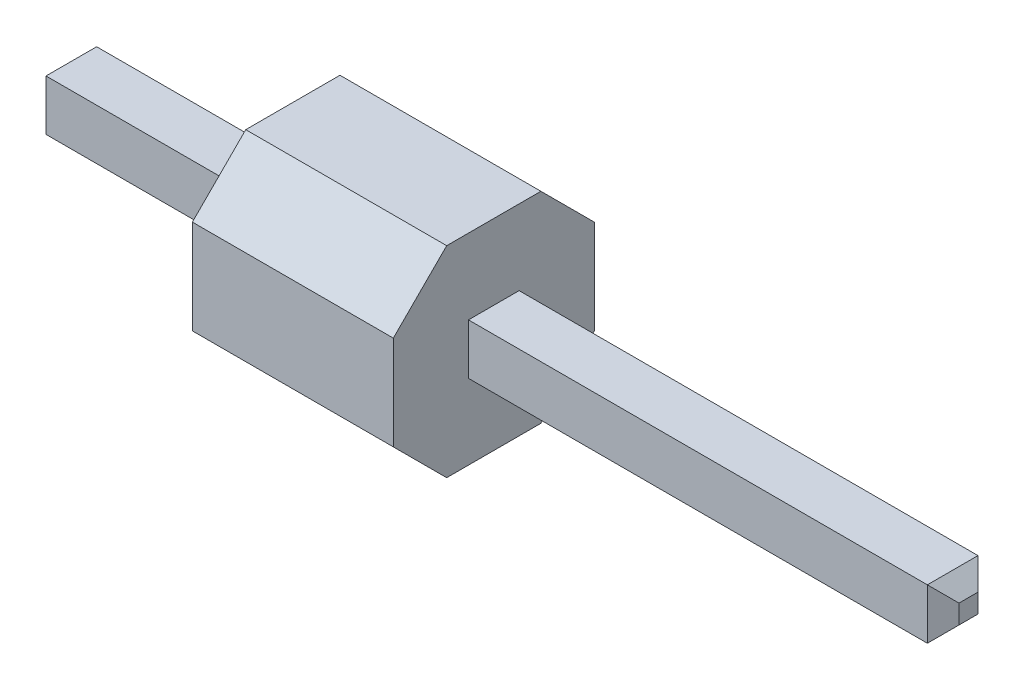
ISO-10303-21;
HEADER;
FILE_DESCRIPTION(('STEP AP214'),'2;1');
FILE_NAME('part.step','',(''),(''),'','','');
FILE_SCHEMA(('AUTOMOTIVE_DESIGN { 1 0 10303 214 1 1 1 1 }'));
ENDSEC;
DATA;
#1=APPLICATION_CONTEXT('core data for automotive mechanical design processes');
#2=APPLICATION_PROTOCOL_DEFINITION('international standard','automotive_design',2000,#1);
#3=PRODUCT_CONTEXT('',#1,'mechanical');
#4=PRODUCT('Part','Part','',(#3));
#5=PRODUCT_RELATED_PRODUCT_CATEGORY('part','',(#4));
#6=PRODUCT_DEFINITION_FORMATION('','',#4);
#7=PRODUCT_DEFINITION_CONTEXT('part definition',#1,'design');
#8=PRODUCT_DEFINITION('design','',#6,#7);
#9=PRODUCT_DEFINITION_SHAPE('','',#8);
#10=(LENGTH_UNIT() NAMED_UNIT(*) SI_UNIT(.MILLI.,.METRE.));
#11=(NAMED_UNIT(*) PLANE_ANGLE_UNIT() SI_UNIT($,.RADIAN.));
#12=(NAMED_UNIT(*) SI_UNIT($,.STERADIAN.) SOLID_ANGLE_UNIT());
#13=UNCERTAINTY_MEASURE_WITH_UNIT(LENGTH_MEASURE(1.E-05),#10,'distance_accuracy_value','');
#14=(GEOMETRIC_REPRESENTATION_CONTEXT(3) GLOBAL_UNCERTAINTY_ASSIGNED_CONTEXT((#13)) GLOBAL_UNIT_ASSIGNED_CONTEXT((#10,
#11,#12)) REPRESENTATION_CONTEXT('',''));
#15=CARTESIAN_POINT('',(0.,0.,0.));
#16=DIRECTION('',(0.,0.,1.));
#17=DIRECTION('',(1.,0.,0.));
#18=AXIS2_PLACEMENT_3D('',#15,#16,#17);
#19=CARTESIAN_POINT('',(-3.,-0.320000000000004,0.32));
#20=DIRECTION('',(0.,0.,1.));
#21=DIRECTION('',(1.,0.,0.));
#22=AXIS2_PLACEMENT_3D('',#19,#20,#21);
#23=PLANE('',#22);
#24=DIRECTION('',(1.,0.,0.));
#25=VECTOR('',#24,1.);
#26=CARTESIAN_POINT('',(-3.,0.319999999999996,0.32));
#27=LINE('',#26,#25);
#28=CARTESIAN_POINT('',(-2.8,0.319999999999996,0.32));
#29=VERTEX_POINT('',#28);
#30=CARTESIAN_POINT('',(8.34,0.319999999999996,0.32));
#31=VERTEX_POINT('',#30);
#32=EDGE_CURVE('E150',#29,#31,#27,.T.);
#33=ORIENTED_EDGE('',*,*,#32,.F.);
#34=DIRECTION('',(0.,-1.,0.));
#35=VECTOR('',#34,1.);
#36=CARTESIAN_POINT('',(-2.8,-0.320000000000004,0.32));
#37=LINE('',#36,#35);
#38=CARTESIAN_POINT('',(-2.8,-0.320000000000004,0.32));
#39=VERTEX_POINT('',#38);
#40=EDGE_CURVE('E170',#29,#39,#37,.T.);
#41=ORIENTED_EDGE('',*,*,#40,.T.);
#42=DIRECTION('',(1.,0.,0.));
#43=VECTOR('',#42,1.);
#44=CARTESIAN_POINT('',(-3.,-0.320000000000004,0.32));
#45=LINE('',#44,#43);
#46=CARTESIAN_POINT('',(8.34,-0.320000000000004,0.32));
#47=VERTEX_POINT('',#46);
#48=EDGE_CURVE('E141',#39,#47,#45,.T.);
#49=ORIENTED_EDGE('',*,*,#48,.T.);
#50=DIRECTION('',(0.,1.,0.));
#51=VECTOR('',#50,1.);
#52=CARTESIAN_POINT('',(8.34,0.319999999999996,0.32));
#53=LINE('',#52,#51);
#54=EDGE_CURVE('E168',#47,#31,#53,.T.);
#55=ORIENTED_EDGE('',*,*,#54,.T.);
#56=EDGE_LOOP('',(#33,#41,#49,#55));
#57=FACE_BOUND('',#56,.T.);
#58=ADVANCED_FACE('F45',(#57),#23,.T.);
#59=CARTESIAN_POINT('',(-3.,0.319999999999996,0.32));
#60=DIRECTION('',(0.,1.,0.));
#61=DIRECTION('',(0.,0.,1.));
#62=AXIS2_PLACEMENT_3D('',#59,#60,#61);
#63=PLANE('',#62);
#64=DIRECTION('',(1.,0.,0.));
#65=VECTOR('',#64,1.);
#66=CARTESIAN_POINT('',(-3.,0.319999999999996,-0.32));
#67=LINE('',#66,#65);
#68=CARTESIAN_POINT('',(-2.8,0.319999999999996,-0.32));
#69=VERTEX_POINT('',#68);
#70=CARTESIAN_POINT('',(8.34,0.319999999999996,-0.32));
#71=VERTEX_POINT('',#70);
#72=EDGE_CURVE('E148',#69,#71,#67,.T.);
#73=ORIENTED_EDGE('',*,*,#72,.F.);
#74=DIRECTION('',(0.,0.,1.));
#75=VECTOR('',#74,1.);
#76=CARTESIAN_POINT('',(-2.8,0.319999999999996,0.32));
#77=LINE('',#76,#75);
#78=EDGE_CURVE('E166',#69,#29,#77,.T.);
#79=ORIENTED_EDGE('',*,*,#78,.T.);
#80=ORIENTED_EDGE('',*,*,#32,.T.);
#81=DIRECTION('',(0.,0.,-1.));
#82=VECTOR('',#81,1.);
#83=CARTESIAN_POINT('',(8.34,0.319999999999996,-0.32));
#84=LINE('',#83,#82);
#85=EDGE_CURVE('E131',#31,#71,#84,.T.);
#86=ORIENTED_EDGE('',*,*,#85,.T.);
#87=EDGE_LOOP('',(#73,#79,#80,#86));
#88=FACE_BOUND('',#87,.T.);
#89=ADVANCED_FACE('F208',(#88),#63,.T.);
#90=CARTESIAN_POINT('',(-3.,-0.320000000000004,-0.32));
#91=DIRECTION('',(0.,0.,-1.));
#92=DIRECTION('',(-1.,0.,0.));
#93=AXIS2_PLACEMENT_3D('',#90,#91,#92);
#94=PLANE('',#93);
#95=DIRECTION('',(1.,0.,0.));
#96=VECTOR('',#95,1.);
#97=CARTESIAN_POINT('',(-3.,-0.320000000000004,-0.32));
#98=LINE('',#97,#96);
#99=CARTESIAN_POINT('',(-2.8,-0.320000000000004,-0.32));
#100=VERTEX_POINT('',#99);
#101=CARTESIAN_POINT('',(8.34,-0.320000000000004,-0.32));
#102=VERTEX_POINT('',#101);
#103=EDGE_CURVE('E138',#100,#102,#98,.T.);
#104=ORIENTED_EDGE('',*,*,#103,.F.);
#105=DIRECTION('',(0.,1.,0.));
#106=VECTOR('',#105,1.);
#107=CARTESIAN_POINT('',(-2.8,-0.320000000000004,-0.32));
#108=LINE('',#107,#106);
#109=EDGE_CURVE('E123',#100,#69,#108,.T.);
#110=ORIENTED_EDGE('',*,*,#109,.T.);
#111=ORIENTED_EDGE('',*,*,#72,.T.);
#112=DIRECTION('',(0.,-1.,0.));
#113=VECTOR('',#112,1.);
#114=CARTESIAN_POINT('',(8.34,-0.320000000000004,-0.32));
#115=LINE('',#114,#113);
#116=EDGE_CURVE('E132',#71,#102,#115,.T.);
#117=ORIENTED_EDGE('',*,*,#116,.T.);
#118=EDGE_LOOP('',(#104,#110,#111,#117));
#119=FACE_BOUND('',#118,.T.);
#120=ADVANCED_FACE('F146',(#119),#94,.T.);
#121=CARTESIAN_POINT('',(-3.,-0.320000000000004,0.32));
#122=DIRECTION('',(0.,-1.,0.));
#123=DIRECTION('',(0.,0.,-1.));
#124=AXIS2_PLACEMENT_3D('',#121,#122,#123);
#125=PLANE('',#124);
#126=ORIENTED_EDGE('',*,*,#48,.F.);
#127=DIRECTION('',(0.,0.,-1.));
#128=VECTOR('',#127,1.);
#129=CARTESIAN_POINT('',(-2.8,-0.320000000000004,0.32));
#130=LINE('',#129,#128);
#131=EDGE_CURVE('E115',#39,#100,#130,.T.);
#132=ORIENTED_EDGE('',*,*,#131,.T.);
#133=ORIENTED_EDGE('',*,*,#103,.T.);
#134=DIRECTION('',(0.,0.,1.));
#135=VECTOR('',#134,1.);
#136=CARTESIAN_POINT('',(8.34,-0.320000000000004,0.32));
#137=LINE('',#136,#135);
#138=EDGE_CURVE('E144',#102,#47,#137,.T.);
#139=ORIENTED_EDGE('',*,*,#138,.T.);
#140=EDGE_LOOP('',(#126,#132,#133,#139));
#141=FACE_BOUND('',#140,.T.);
#142=ADVANCED_FACE('F137',(#141),#125,.T.);
#143=CARTESIAN_POINT('',(-3.,0.,0.));
#144=DIRECTION('',(-1.,0.,0.));
#145=DIRECTION('',(0.,0.,1.));
#146=AXIS2_PLACEMENT_3D('',#143,#144,#145);
#147=PLANE('',#146);
#148=DIRECTION('',(0.,-1.,0.));
#149=VECTOR('',#148,1.);
#150=CARTESIAN_POINT('',(-3.,0.,-0.120000000000001));
#151=LINE('',#150,#149);
#152=CARTESIAN_POINT('',(-3.,0.119999999999997,-0.120000000000001));
#153=VERTEX_POINT('',#152);
#154=CARTESIAN_POINT('',(-3.,-0.120000000000006,-0.120000000000001));
#155=VERTEX_POINT('',#154);
#156=EDGE_CURVE('E160',#153,#155,#151,.T.);
#157=ORIENTED_EDGE('',*,*,#156,.T.);
#158=DIRECTION('',(0.,0.,1.));
#159=VECTOR('',#158,1.);
#160=CARTESIAN_POINT('',(-3.,-0.120000000000006,0.));
#161=LINE('',#160,#159);
#162=CARTESIAN_POINT('',(-3.,-0.120000000000006,0.120000000000001));
#163=VERTEX_POINT('',#162);
#164=EDGE_CURVE('E117',#155,#163,#161,.T.);
#165=ORIENTED_EDGE('',*,*,#164,.T.);
#166=DIRECTION('',(0.,1.,0.));
#167=VECTOR('',#166,1.);
#168=CARTESIAN_POINT('',(-3.,0.,0.120000000000001));
#169=LINE('',#168,#167);
#170=CARTESIAN_POINT('',(-3.,0.119999999999997,0.120000000000001));
#171=VERTEX_POINT('',#170);
#172=EDGE_CURVE('E143',#163,#171,#169,.T.);
#173=ORIENTED_EDGE('',*,*,#172,.T.);
#174=DIRECTION('',(0.,0.,-1.));
#175=VECTOR('',#174,1.);
#176=CARTESIAN_POINT('',(-3.,0.119999999999997,0.));
#177=LINE('',#176,#175);
#178=EDGE_CURVE('E158',#171,#153,#177,.T.);
#179=ORIENTED_EDGE('',*,*,#178,.T.);
#180=EDGE_LOOP('',(#157,#165,#173,#179));
#181=FACE_BOUND('',#180,.T.);
#182=ADVANCED_FACE('F203',(#181),#147,.T.);
#183=CARTESIAN_POINT('',(8.54,0.,0.));
#184=DIRECTION('',(-1.,0.,0.));
#185=DIRECTION('',(0.,0.,1.));
#186=AXIS2_PLACEMENT_3D('',#183,#184,#185);
#187=PLANE('',#186);
#188=DIRECTION('',(0.,1.,0.));
#189=VECTOR('',#188,1.);
#190=CARTESIAN_POINT('',(8.54,0.319999999999996,-0.120000000000001));
#191=LINE('',#190,#189);
#192=CARTESIAN_POINT('',(8.54,-0.120000000000006,-0.120000000000001));
#193=VERTEX_POINT('',#192);
#194=CARTESIAN_POINT('',(8.54,0.119999999999997,-0.120000000000001));
#195=VERTEX_POINT('',#194);
#196=EDGE_CURVE('E54',#193,#195,#191,.T.);
#197=ORIENTED_EDGE('',*,*,#196,.T.);
#198=DIRECTION('',(0.,0.,1.));
#199=VECTOR('',#198,1.);
#200=CARTESIAN_POINT('',(8.54,0.119999999999997,0.32));
#201=LINE('',#200,#199);
#202=CARTESIAN_POINT('',(8.54,0.119999999999997,0.120000000000001));
#203=VERTEX_POINT('',#202);
#204=EDGE_CURVE('E12',#195,#203,#201,.T.);
#205=ORIENTED_EDGE('',*,*,#204,.T.);
#206=DIRECTION('',(0.,-1.,0.));
#207=VECTOR('',#206,1.);
#208=CARTESIAN_POINT('',(8.54,-0.320000000000004,0.120000000000001));
#209=LINE('',#208,#207);
#210=CARTESIAN_POINT('',(8.54,-0.120000000000006,0.120000000000001));
#211=VERTEX_POINT('',#210);
#212=EDGE_CURVE('E172',#203,#211,#209,.T.);
#213=ORIENTED_EDGE('',*,*,#212,.T.);
#214=DIRECTION('',(0.,0.,-1.));
#215=VECTOR('',#214,1.);
#216=CARTESIAN_POINT('',(8.54,-0.120000000000006,-0.32));
#217=LINE('',#216,#215);
#218=EDGE_CURVE('E65',#211,#193,#217,.T.);
#219=ORIENTED_EDGE('',*,*,#218,.T.);
#220=EDGE_LOOP('',(#197,#205,#213,#219));
#221=FACE_BOUND('',#220,.T.);
#222=ADVANCED_FACE('F215',(#221),#187,.F.);
#223=CARTESIAN_POINT('',(-2.8,0.319999999999996,0.32));
#224=DIRECTION('',(0.707106781186551,-0.707106781186544,0.));
#225=DIRECTION('',(0.,0.,1.));
#226=AXIS2_PLACEMENT_3D('',#223,#224,#225);
#227=PLANE('',#226);
#228=DIRECTION('',(-0.577350269189622,-0.577350269189627,0.577350269189627));
#229=VECTOR('',#228,1.);
#230=CARTESIAN_POINT('',(-3.01333333333334,0.106666666666661,-0.106666666666665));
#231=LINE('',#230,#229);
#232=EDGE_CURVE('E126',#153,#69,#231,.F.);
#233=ORIENTED_EDGE('',*,*,#232,.F.);
#234=ORIENTED_EDGE('',*,*,#178,.F.);
#235=DIRECTION('',(-0.577350269189622,-0.577350269189627,-0.577350269189627));
#236=VECTOR('',#235,1.);
#237=CARTESIAN_POINT('',(-3.01333333333334,0.106666666666661,0.106666666666665));
#238=LINE('',#237,#236);
#239=EDGE_CURVE('E152',#29,#171,#238,.T.);
#240=ORIENTED_EDGE('',*,*,#239,.F.);
#241=ORIENTED_EDGE('',*,*,#78,.F.);
#242=EDGE_LOOP('',(#233,#234,#240,#241));
#243=FACE_BOUND('',#242,.T.);
#244=ADVANCED_FACE('F206',(#243),#227,.F.);
#245=CARTESIAN_POINT('',(-2.8,-0.320000000000004,0.32));
#246=DIRECTION('',(0.707106781186551,0.,-0.707106781186544));
#247=DIRECTION('',(0.,-1.,0.));
#248=AXIS2_PLACEMENT_3D('',#245,#246,#247);
#249=PLANE('',#248);
#250=ORIENTED_EDGE('',*,*,#239,.T.);
#251=ORIENTED_EDGE('',*,*,#172,.F.);
#252=DIRECTION('',(0.577350269189622,-0.577350269189627,0.577350269189627));
#253=VECTOR('',#252,1.);
#254=CARTESIAN_POINT('',(-2.8,-0.320000000000004,0.32));
#255=LINE('',#254,#253);
#256=EDGE_CURVE('E120',#39,#163,#255,.F.);
#257=ORIENTED_EDGE('',*,*,#256,.F.);
#258=ORIENTED_EDGE('',*,*,#40,.F.);
#259=EDGE_LOOP('',(#250,#251,#257,#258));
#260=FACE_BOUND('',#259,.T.);
#261=ADVANCED_FACE('F199',(#260),#249,.F.);
#262=CARTESIAN_POINT('',(-2.8,-0.320000000000004,-0.32));
#263=DIRECTION('',(0.707106781186551,0.,0.707106781186544));
#264=DIRECTION('',(0.,1.,0.));
#265=AXIS2_PLACEMENT_3D('',#262,#263,#264);
#266=PLANE('',#265);
#267=ORIENTED_EDGE('',*,*,#232,.T.);
#268=ORIENTED_EDGE('',*,*,#109,.F.);
#269=DIRECTION('',(-0.577350269189622,0.577350269189627,0.577350269189627));
#270=VECTOR('',#269,1.);
#271=CARTESIAN_POINT('',(-2.8,-0.320000000000004,-0.32));
#272=LINE('',#271,#270);
#273=EDGE_CURVE('E111',#155,#100,#272,.F.);
#274=ORIENTED_EDGE('',*,*,#273,.F.);
#275=ORIENTED_EDGE('',*,*,#156,.F.);
#276=EDGE_LOOP('',(#267,#268,#274,#275));
#277=FACE_BOUND('',#276,.T.);
#278=ADVANCED_FACE('F124',(#277),#266,.F.);
#279=CARTESIAN_POINT('',(-2.8,-0.320000000000004,0.32));
#280=DIRECTION('',(0.707106781186551,0.707106781186544,0.));
#281=DIRECTION('',(0.,0.,-1.));
#282=AXIS2_PLACEMENT_3D('',#279,#280,#281);
#283=PLANE('',#282);
#284=ORIENTED_EDGE('',*,*,#256,.T.);
#285=ORIENTED_EDGE('',*,*,#164,.F.);
#286=ORIENTED_EDGE('',*,*,#273,.T.);
#287=ORIENTED_EDGE('',*,*,#131,.F.);
#288=EDGE_LOOP('',(#284,#285,#286,#287));
#289=FACE_BOUND('',#288,.T.);
#290=ADVANCED_FACE('F113',(#289),#283,.F.);
#291=CARTESIAN_POINT('',(8.54,-0.120000000000006,0.));
#292=DIRECTION('',(0.707106781186548,-0.707106781186548,0.));
#293=DIRECTION('',(0.,0.,1.));
#294=AXIS2_PLACEMENT_3D('',#291,#292,#293);
#295=PLANE('',#294);
#296=DIRECTION('',(0.577350269189626,0.577350269189626,-0.577350269189626));
#297=VECTOR('',#296,1.);
#298=CARTESIAN_POINT('',(8.58,-0.0800000000000037,0.0799999999999993));
#299=LINE('',#298,#297);
#300=EDGE_CURVE('E183',#47,#211,#299,.T.);
#301=ORIENTED_EDGE('',*,*,#300,.F.);
#302=ORIENTED_EDGE('',*,*,#138,.F.);
#303=DIRECTION('',(0.577350269189626,0.577350269189626,0.577350269189626));
#304=VECTOR('',#303,1.);
#305=CARTESIAN_POINT('',(8.58,-0.0800000000000052,-0.0800000000000008));
#306=LINE('',#305,#304);
#307=EDGE_CURVE('E49',#193,#102,#306,.F.);
#308=ORIENTED_EDGE('',*,*,#307,.F.);
#309=ORIENTED_EDGE('',*,*,#218,.F.);
#310=EDGE_LOOP('',(#301,#302,#308,#309));
#311=FACE_BOUND('',#310,.T.);
#312=ADVANCED_FACE('F47',(#311),#295,.T.);
#313=CARTESIAN_POINT('',(8.54,0.,-0.120000000000001));
#314=DIRECTION('',(0.707106781186548,0.,-0.707106781186548));
#315=DIRECTION('',(0.,-1.,0.));
#316=AXIS2_PLACEMENT_3D('',#313,#314,#315);
#317=PLANE('',#316);
#318=ORIENTED_EDGE('',*,*,#307,.T.);
#319=ORIENTED_EDGE('',*,*,#116,.F.);
#320=DIRECTION('',(0.577350269189626,-0.577350269189626,0.577350269189626));
#321=VECTOR('',#320,1.);
#322=CARTESIAN_POINT('',(8.58,0.0799999999999979,-0.0800000000000023));
#323=LINE('',#322,#321);
#324=EDGE_CURVE('E182',#195,#71,#323,.F.);
#325=ORIENTED_EDGE('',*,*,#324,.F.);
#326=ORIENTED_EDGE('',*,*,#196,.F.);
#327=EDGE_LOOP('',(#318,#319,#325,#326));
#328=FACE_BOUND('',#327,.T.);
#329=ADVANCED_FACE('F191',(#328),#317,.T.);
#330=CARTESIAN_POINT('',(8.54,0.,0.120000000000001));
#331=DIRECTION('',(0.707106781186548,0.,0.707106781186548));
#332=DIRECTION('',(0.,1.,0.));
#333=AXIS2_PLACEMENT_3D('',#330,#331,#332);
#334=PLANE('',#333);
#335=ORIENTED_EDGE('',*,*,#300,.T.);
#336=ORIENTED_EDGE('',*,*,#212,.F.);
#337=DIRECTION('',(-0.577350269189626,0.577350269189626,0.577350269189626));
#338=VECTOR('',#337,1.);
#339=CARTESIAN_POINT('',(8.58,0.0799999999999979,0.0800000000000022));
#340=LINE('',#339,#338);
#341=EDGE_CURVE('E180',#31,#203,#340,.F.);
#342=ORIENTED_EDGE('',*,*,#341,.F.);
#343=ORIENTED_EDGE('',*,*,#54,.F.);
#344=EDGE_LOOP('',(#335,#336,#342,#343));
#345=FACE_BOUND('',#344,.T.);
#346=ADVANCED_FACE('F214',(#345),#334,.T.);
#347=CARTESIAN_POINT('',(8.54,0.119999999999997,0.));
#348=DIRECTION('',(0.707106781186548,0.707106781186548,0.));
#349=DIRECTION('',(0.,0.,-1.));
#350=AXIS2_PLACEMENT_3D('',#347,#348,#349);
#351=PLANE('',#350);
#352=ORIENTED_EDGE('',*,*,#324,.T.);
#353=ORIENTED_EDGE('',*,*,#85,.F.);
#354=ORIENTED_EDGE('',*,*,#341,.T.);
#355=ORIENTED_EDGE('',*,*,#204,.F.);
#356=EDGE_LOOP('',(#352,#353,#354,#355));
#357=FACE_BOUND('',#356,.T.);
#358=ADVANCED_FACE('F212',(#357),#351,.T.);
#359=CLOSED_SHELL('',(#58,#89,#120,#142,#182,#222,#244,#261,#278,#290,#312,#329,#346,#358));
#360=MANIFOLD_SOLID_BREP('B2',#359);
#361=CARTESIAN_POINT('',(2.54,0.,-1.27));
#362=DIRECTION('',(0.,0.,-1.));
#363=DIRECTION('',(-1.,0.,0.));
#364=AXIS2_PLACEMENT_3D('',#361,#362,#363);
#365=PLANE('',#364);
#366=DIRECTION('',(-1.,0.,0.));
#367=VECTOR('',#366,1.);
#368=CARTESIAN_POINT('',(2.54,-0.595482683000005,-1.27));
#369=LINE('',#368,#367);
#370=CARTESIAN_POINT('',(2.54,-0.595482683000005,-1.27));
#371=VERTEX_POINT('',#370);
#372=CARTESIAN_POINT('',(0.516526244231714,-0.595482683000005,-1.27));
#373=VERTEX_POINT('',#372);
#374=EDGE_CURVE('E353',#371,#373,#369,.T.);
#375=ORIENTED_EDGE('',*,*,#374,.T.);
#376=DIRECTION('',(0.,1.,0.));
#377=VECTOR('',#376,1.);
#378=CARTESIAN_POINT('',(0.516526244231714,0.,-1.27));
#379=LINE('',#378,#377);
#380=CARTESIAN_POINT('',(0.516526244231714,0.595482682999996,-1.27));
#381=VERTEX_POINT('',#380);
#382=EDGE_CURVE('E523',#373,#381,#379,.T.);
#383=ORIENTED_EDGE('',*,*,#382,.T.);
#384=DIRECTION('',(-1.,0.,0.));
#385=VECTOR('',#384,1.);
#386=CARTESIAN_POINT('',(2.54,0.595482682999996,-1.27));
#387=LINE('',#386,#385);
#388=CARTESIAN_POINT('',(2.54,0.595482682999996,-1.27));
#389=VERTEX_POINT('',#388);
#390=EDGE_CURVE('E501',#389,#381,#387,.T.);
#391=ORIENTED_EDGE('',*,*,#390,.F.);
#392=DIRECTION('',(0.,-1.,0.));
#393=VECTOR('',#392,1.);
#394=CARTESIAN_POINT('',(2.54,0.,-1.27));
#395=LINE('',#394,#393);
#396=EDGE_CURVE('E524',#389,#371,#395,.T.);
#397=ORIENTED_EDGE('',*,*,#396,.T.);
#398=EDGE_LOOP('',(#375,#383,#391,#397));
#399=FACE_BOUND('',#398,.T.);
#400=ADVANCED_FACE('F329',(#399),#365,.T.);
#401=CARTESIAN_POINT('',(2.54,0.932741341499998,-0.932741341499998));
#402=DIRECTION('',(0.,-0.707106781186548,0.707106781186547));
#403=DIRECTION('',(0.,-0.707106781186547,-0.707106781186548));
#404=AXIS2_PLACEMENT_3D('',#401,#402,#403);
#405=PLANE('',#404);
#406=DIRECTION('',(0.843892829702787,-0.37937111907486,-0.37937111907486));
#407=VECTOR('',#406,1.);
#408=CARTESIAN_POINT('',(1.80013672972488,0.109846190350624,-1.75563649264937));
#409=LINE('',#408,#407);
#410=CARTESIAN_POINT('',(0.,0.919095732006294,-0.946386950993702));
#411=VERTEX_POINT('',#410);
#412=CARTESIAN_POINT('',(0.457528496239407,0.713414285834849,-1.15206839716515));
#413=VERTEX_POINT('',#412);
#414=EDGE_CURVE('E552',#411,#413,#409,.T.);
#415=ORIENTED_EDGE('',*,*,#414,.F.);
#416=DIRECTION('',(0.,0.707106781186547,0.707106781186548));
#417=VECTOR('',#416,1.);
#418=CARTESIAN_POINT('',(0.,0.932741341499998,-0.932741341499998));
#419=LINE('',#418,#417);
#420=CARTESIAN_POINT('',(0.,1.27,-0.595482683));
#421=VERTEX_POINT('',#420);
#422=EDGE_CURVE('E473',#411,#421,#419,.T.);
#423=ORIENTED_EDGE('',*,*,#422,.T.);
#424=DIRECTION('',(-1.,0.,0.));
#425=VECTOR('',#424,1.);
#426=CARTESIAN_POINT('',(2.54,1.27,-0.595482683));
#427=LINE('',#426,#425);
#428=CARTESIAN_POINT('',(2.54,1.27,-0.595482683));
#429=VERTEX_POINT('',#428);
#430=EDGE_CURVE('E498',#429,#421,#427,.T.);
#431=ORIENTED_EDGE('',*,*,#430,.F.);
#432=DIRECTION('',(0.,0.707106781186547,0.707106781186548));
#433=VECTOR('',#432,1.);
#434=CARTESIAN_POINT('',(2.54,0.932741341499998,-0.932741341499998));
#435=LINE('',#434,#433);
#436=EDGE_CURVE('E527',#389,#429,#435,.T.);
#437=ORIENTED_EDGE('',*,*,#436,.F.);
#438=ORIENTED_EDGE('',*,*,#390,.T.);
#439=DIRECTION('',(0.,-0.707106781186547,-0.707106781186548));
#440=VECTOR('',#439,1.);
#441=CARTESIAN_POINT('',(0.516526244231711,0.93274134149999,-0.932741341500006));
#442=LINE('',#441,#440);
#443=CARTESIAN_POINT('',(0.516526244231714,0.62220674595849,-1.24327593704151));
#444=VERTEX_POINT('',#443);
#445=EDGE_CURVE('E557',#444,#381,#442,.T.);
#446=ORIENTED_EDGE('',*,*,#445,.F.);
#447=CARTESIAN_POINT('',(0.416526244231714,0.62220674595849,-1.24327593704151));
#448=DIRECTION('',(0.,-0.707106781186548,0.707106781186547));
#449=DIRECTION('',(0.,-0.707106781186547,-0.707106781186548));
#450=AXIS2_PLACEMENT_3D('',#447,#448,#449);
#451=ELLIPSE('',#450,0.141421356237309,0.0999999999999998);
#452=EDGE_CURVE('E465',#413,#444,#451,.F.);
#453=ORIENTED_EDGE('',*,*,#452,.F.);
#454=EDGE_LOOP('',(#415,#423,#431,#437,#438,#446,#453));
#455=FACE_BOUND('',#454,.T.);
#456=ADVANCED_FACE('F549',(#455),#405,.F.);
#457=CARTESIAN_POINT('',(2.54,-0.932741341500002,-0.932741341500002));
#458=DIRECTION('',(0.,-0.707106781186548,-0.707106781186548));
#459=DIRECTION('',(0.,0.707106781186548,-0.707106781186548));
#460=AXIS2_PLACEMENT_3D('',#457,#458,#459);
#461=PLANE('',#460);
#462=DIRECTION('',(0.,-0.707106781186548,0.707106781186548));
#463=VECTOR('',#462,1.);
#464=CARTESIAN_POINT('',(0.,-0.932741341500002,-0.932741341500002));
#465=LINE('',#464,#463);
#466=CARTESIAN_POINT('',(0.,-0.919095732006303,-0.946386950993702));
#467=VERTEX_POINT('',#466);
#468=CARTESIAN_POINT('',(0.,-1.27,-0.595482683));
#469=VERTEX_POINT('',#468);
#470=EDGE_CURVE('E393',#467,#469,#465,.T.);
#471=ORIENTED_EDGE('',*,*,#470,.F.);
#472=DIRECTION('',(0.843892829702787,0.37937111907486,-0.37937111907486));
#473=VECTOR('',#472,1.);
#474=CARTESIAN_POINT('',(1.80013672972488,-0.109846190350631,-1.75563649264937));
#475=LINE('',#474,#473);
#476=CARTESIAN_POINT('',(0.457528496239407,-0.713414285834858,-1.15206839716515));
#477=VERTEX_POINT('',#476);
#478=EDGE_CURVE('E344',#467,#477,#475,.T.);
#479=ORIENTED_EDGE('',*,*,#478,.T.);
#480=CARTESIAN_POINT('',(0.416526244231714,-0.622206745958499,-1.24327593704151));
#481=DIRECTION('',(0.,-0.707106781186548,-0.707106781186548));
#482=DIRECTION('',(0.,-0.707106781186548,0.707106781186548));
#483=AXIS2_PLACEMENT_3D('',#480,#481,#482);
#484=ELLIPSE('',#483,0.141421356237309,0.0999999999999998);
#485=CARTESIAN_POINT('',(0.516526244231714,-0.622206745958498,-1.24327593704151));
#486=VERTEX_POINT('',#485);
#487=EDGE_CURVE('E43',#477,#486,#484,.F.);
#488=ORIENTED_EDGE('',*,*,#487,.T.);
#489=DIRECTION('',(0.,0.707106781186548,-0.707106781186548));
#490=VECTOR('',#489,1.);
#491=CARTESIAN_POINT('',(0.516526244231711,-0.932741341499994,-0.932741341500011));
#492=LINE('',#491,#490);
#493=EDGE_CURVE('E337',#486,#373,#492,.T.);
#494=ORIENTED_EDGE('',*,*,#493,.T.);
#495=ORIENTED_EDGE('',*,*,#374,.F.);
#496=DIRECTION('',(0.,-0.707106781186548,0.707106781186548));
#497=VECTOR('',#496,1.);
#498=CARTESIAN_POINT('',(2.54,-0.932741341500002,-0.932741341500002));
#499=LINE('',#498,#497);
#500=CARTESIAN_POINT('',(2.54,-1.27,-0.595482683));
#501=VERTEX_POINT('',#500);
#502=EDGE_CURVE('E455',#371,#501,#499,.T.);
#503=ORIENTED_EDGE('',*,*,#502,.T.);
#504=DIRECTION('',(-1.,0.,0.));
#505=VECTOR('',#504,1.);
#506=CARTESIAN_POINT('',(2.54,-1.27,-0.595482683));
#507=LINE('',#506,#505);
#508=EDGE_CURVE('E442',#501,#469,#507,.T.);
#509=ORIENTED_EDGE('',*,*,#508,.T.);
#510=EDGE_LOOP('',(#471,#479,#488,#494,#495,#503,#509));
#511=FACE_BOUND('',#510,.T.);
#512=ADVANCED_FACE('F514',(#511),#461,.T.);
#513=CARTESIAN_POINT('',(0.,0.,0.));
#514=DIRECTION('',(1.,0.,0.));
#515=DIRECTION('',(0.,0.,-1.));
#516=AXIS2_PLACEMENT_3D('',#513,#514,#515);
#517=PLANE('',#516);
#518=DIRECTION('',(0.,-1.,0.));
#519=VECTOR('',#518,1.);
#520=CARTESIAN_POINT('',(0.,0.,0.32));
#521=LINE('',#520,#519);
#522=CARTESIAN_POINT('',(0.,0.319999999999996,0.32));
#523=VERTEX_POINT('',#522);
#524=CARTESIAN_POINT('',(0.,-0.320000000000004,0.32));
#525=VERTEX_POINT('',#524);
#526=EDGE_CURVE('E461',#523,#525,#521,.T.);
#527=ORIENTED_EDGE('',*,*,#526,.T.);
#528=DIRECTION('',(0.,0.,1.));
#529=VECTOR('',#528,1.);
#530=CARTESIAN_POINT('',(0.,-0.320000000000004,0.));
#531=LINE('',#530,#529);
#532=CARTESIAN_POINT('',(0.,-0.320000000000004,-0.32));
#533=VERTEX_POINT('',#532);
#534=EDGE_CURVE('E470',#533,#525,#531,.T.);
#535=ORIENTED_EDGE('',*,*,#534,.F.);
#536=DIRECTION('',(0.,-1.,0.));
#537=VECTOR('',#536,1.);
#538=CARTESIAN_POINT('',(0.,0.,-0.32));
#539=LINE('',#538,#537);
#540=CARTESIAN_POINT('',(0.,0.319999999999996,-0.32));
#541=VERTEX_POINT('',#540);
#542=EDGE_CURVE('E468',#541,#533,#539,.T.);
#543=ORIENTED_EDGE('',*,*,#542,.F.);
#544=DIRECTION('',(0.,0.,1.));
#545=VECTOR('',#544,1.);
#546=CARTESIAN_POINT('',(0.,0.319999999999996,0.));
#547=LINE('',#546,#545);
#548=EDGE_CURVE('E464',#541,#523,#547,.T.);
#549=ORIENTED_EDGE('',*,*,#548,.T.);
#550=EDGE_LOOP('',(#527,#535,#543,#549));
#551=FACE_BOUND('',#550,.T.);
#552=DIRECTION('',(0.,1.,0.));
#553=VECTOR('',#552,1.);
#554=CARTESIAN_POINT('',(0.,0.,-0.946386950993702));
#555=LINE('',#554,#553);
#556=EDGE_CURVE('E504',#467,#411,#555,.T.);
#557=ORIENTED_EDGE('',*,*,#556,.F.);
#558=ORIENTED_EDGE('',*,*,#470,.T.);
#559=DIRECTION('',(0.,0.,1.));
#560=VECTOR('',#559,1.);
#561=CARTESIAN_POINT('',(0.,-1.27,0.));
#562=LINE('',#561,#560);
#563=CARTESIAN_POINT('',(0.,-1.27,0.595482683));
#564=VERTEX_POINT('',#563);
#565=EDGE_CURVE('E485',#469,#564,#562,.T.);
#566=ORIENTED_EDGE('',*,*,#565,.T.);
#567=DIRECTION('',(0.,0.707106781186547,0.707106781186548));
#568=VECTOR('',#567,1.);
#569=CARTESIAN_POINT('',(0.,-0.932741341500003,0.932741341500002));
#570=LINE('',#569,#568);
#571=CARTESIAN_POINT('',(0.,-0.595482683000005,1.27));
#572=VERTEX_POINT('',#571);
#573=EDGE_CURVE('E437',#564,#572,#570,.T.);
#574=ORIENTED_EDGE('',*,*,#573,.T.);
#575=DIRECTION('',(0.,-1.,0.));
#576=VECTOR('',#575,1.);
#577=CARTESIAN_POINT('',(0.,0.,1.27));
#578=LINE('',#577,#576);
#579=CARTESIAN_POINT('',(0.,0.595482682999995,1.27));
#580=VERTEX_POINT('',#579);
#581=EDGE_CURVE('E481',#580,#572,#578,.T.);
#582=ORIENTED_EDGE('',*,*,#581,.F.);
#583=DIRECTION('',(0.,-0.707106781186548,0.707106781186548));
#584=VECTOR('',#583,1.);
#585=CARTESIAN_POINT('',(0.,0.932741341499998,0.932741341499998));
#586=LINE('',#585,#584);
#587=CARTESIAN_POINT('',(0.,1.27,0.595482683));
#588=VERTEX_POINT('',#587);
#589=EDGE_CURVE('E478',#588,#580,#586,.T.);
#590=ORIENTED_EDGE('',*,*,#589,.F.);
#591=DIRECTION('',(0.,0.,1.));
#592=VECTOR('',#591,1.);
#593=CARTESIAN_POINT('',(0.,1.27,0.));
#594=LINE('',#593,#592);
#595=EDGE_CURVE('E475',#421,#588,#594,.T.);
#596=ORIENTED_EDGE('',*,*,#595,.F.);
#597=ORIENTED_EDGE('',*,*,#422,.F.);
#598=EDGE_LOOP('',(#557,#558,#566,#574,#582,#590,#596,#597));
#599=FACE_BOUND('',#598,.T.);
#600=ADVANCED_FACE('F530',(#551,#599),#517,.F.);
#601=CARTESIAN_POINT('',(2.54,1.27,0.));
#602=DIRECTION('',(0.,-1.,0.));
#603=DIRECTION('',(0.,0.,-1.));
#604=AXIS2_PLACEMENT_3D('',#601,#602,#603);
#605=PLANE('',#604);
#606=ORIENTED_EDGE('',*,*,#595,.T.);
#607=DIRECTION('',(-1.,0.,0.));
#608=VECTOR('',#607,1.);
#609=CARTESIAN_POINT('',(2.54,1.27,0.595482683));
#610=LINE('',#609,#608);
#611=CARTESIAN_POINT('',(2.54,1.27,0.595482683));
#612=VERTEX_POINT('',#611);
#613=EDGE_CURVE('E495',#612,#588,#610,.T.);
#614=ORIENTED_EDGE('',*,*,#613,.F.);
#615=DIRECTION('',(0.,0.,1.));
#616=VECTOR('',#615,1.);
#617=CARTESIAN_POINT('',(2.54,1.27,0.));
#618=LINE('',#617,#616);
#619=EDGE_CURVE('E574',#429,#612,#618,.T.);
#620=ORIENTED_EDGE('',*,*,#619,.F.);
#621=ORIENTED_EDGE('',*,*,#430,.T.);
#622=EDGE_LOOP('',(#606,#614,#620,#621));
#623=FACE_BOUND('',#622,.T.);
#624=ADVANCED_FACE('F541',(#623),#605,.F.);
#625=CARTESIAN_POINT('',(2.54,0.932741341499998,0.932741341499998));
#626=DIRECTION('',(0.,-0.707106781186548,-0.707106781186548));
#627=DIRECTION('',(0.,0.707106781186548,-0.707106781186548));
#628=AXIS2_PLACEMENT_3D('',#625,#626,#627);
#629=PLANE('',#628);
#630=ORIENTED_EDGE('',*,*,#589,.T.);
#631=DIRECTION('',(-1.,0.,0.));
#632=VECTOR('',#631,1.);
#633=CARTESIAN_POINT('',(2.54,0.595482682999995,1.27));
#634=LINE('',#633,#632);
#635=CARTESIAN_POINT('',(2.54,0.595482682999995,1.27));
#636=VERTEX_POINT('',#635);
#637=EDGE_CURVE('E492',#636,#580,#634,.T.);
#638=ORIENTED_EDGE('',*,*,#637,.F.);
#639=DIRECTION('',(0.,-0.707106781186548,0.707106781186548));
#640=VECTOR('',#639,1.);
#641=CARTESIAN_POINT('',(2.54,0.932741341499998,0.932741341499998));
#642=LINE('',#641,#640);
#643=EDGE_CURVE('E538',#612,#636,#642,.T.);
#644=ORIENTED_EDGE('',*,*,#643,.F.);
#645=ORIENTED_EDGE('',*,*,#613,.T.);
#646=EDGE_LOOP('',(#630,#638,#644,#645));
#647=FACE_BOUND('',#646,.T.);
#648=ADVANCED_FACE('F536',(#647),#629,.F.);
#649=CARTESIAN_POINT('',(2.54,0.,1.27));
#650=DIRECTION('',(0.,0.,-1.));
#651=DIRECTION('',(-1.,0.,0.));
#652=AXIS2_PLACEMENT_3D('',#649,#650,#651);
#653=PLANE('',#652);
#654=ORIENTED_EDGE('',*,*,#581,.T.);
#655=DIRECTION('',(-1.,0.,0.));
#656=VECTOR('',#655,1.);
#657=CARTESIAN_POINT('',(2.54,-0.595482683000005,1.27));
#658=LINE('',#657,#656);
#659=CARTESIAN_POINT('',(2.54,-0.595482683000005,1.27));
#660=VERTEX_POINT('',#659);
#661=EDGE_CURVE('E441',#660,#572,#658,.T.);
#662=ORIENTED_EDGE('',*,*,#661,.F.);
#663=DIRECTION('',(0.,-1.,0.));
#664=VECTOR('',#663,1.);
#665=CARTESIAN_POINT('',(2.54,0.,1.27));
#666=LINE('',#665,#664);
#667=EDGE_CURVE('E451',#636,#660,#666,.T.);
#668=ORIENTED_EDGE('',*,*,#667,.F.);
#669=ORIENTED_EDGE('',*,*,#637,.T.);
#670=EDGE_LOOP('',(#654,#662,#668,#669));
#671=FACE_BOUND('',#670,.T.);
#672=ADVANCED_FACE('F534',(#671),#653,.F.);
#673=CARTESIAN_POINT('',(2.54,-0.932741341500003,0.932741341500002));
#674=DIRECTION('',(0.,-0.707106781186548,0.707106781186547));
#675=DIRECTION('',(0.,-0.707106781186547,-0.707106781186548));
#676=AXIS2_PLACEMENT_3D('',#673,#674,#675);
#677=PLANE('',#676);
#678=ORIENTED_EDGE('',*,*,#573,.F.);
#679=DIRECTION('',(-1.,0.,0.));
#680=VECTOR('',#679,1.);
#681=CARTESIAN_POINT('',(2.54,-1.27,0.595482683));
#682=LINE('',#681,#680);
#683=CARTESIAN_POINT('',(2.54,-1.27,0.595482683));
#684=VERTEX_POINT('',#683);
#685=EDGE_CURVE('E432',#684,#564,#682,.T.);
#686=ORIENTED_EDGE('',*,*,#685,.F.);
#687=DIRECTION('',(0.,0.707106781186547,0.707106781186548));
#688=VECTOR('',#687,1.);
#689=CARTESIAN_POINT('',(2.54,-0.932741341500003,0.932741341500002));
#690=LINE('',#689,#688);
#691=EDGE_CURVE('E435',#684,#660,#690,.T.);
#692=ORIENTED_EDGE('',*,*,#691,.T.);
#693=ORIENTED_EDGE('',*,*,#661,.T.);
#694=EDGE_LOOP('',(#678,#686,#692,#693));
#695=FACE_BOUND('',#694,.T.);
#696=ADVANCED_FACE('F434',(#695),#677,.T.);
#697=CARTESIAN_POINT('',(2.54,-1.27,0.));
#698=DIRECTION('',(0.,-1.,0.));
#699=DIRECTION('',(0.,0.,-1.));
#700=AXIS2_PLACEMENT_3D('',#697,#698,#699);
#701=PLANE('',#700);
#702=ORIENTED_EDGE('',*,*,#565,.F.);
#703=ORIENTED_EDGE('',*,*,#508,.F.);
#704=DIRECTION('',(0.,0.,1.));
#705=VECTOR('',#704,1.);
#706=CARTESIAN_POINT('',(2.54,-1.27,0.));
#707=LINE('',#706,#705);
#708=EDGE_CURVE('E449',#501,#684,#707,.T.);
#709=ORIENTED_EDGE('',*,*,#708,.T.);
#710=ORIENTED_EDGE('',*,*,#685,.T.);
#711=EDGE_LOOP('',(#702,#703,#709,#710));
#712=FACE_BOUND('',#711,.T.);
#713=ADVANCED_FACE('F454',(#712),#701,.T.);
#714=CARTESIAN_POINT('',(2.54,0.,0.32));
#715=DIRECTION('',(0.,0.,-1.));
#716=DIRECTION('',(0.,1.,0.));
#717=AXIS2_PLACEMENT_3D('',#714,#715,#716);
#718=PLANE('',#717);
#719=ORIENTED_EDGE('',*,*,#526,.F.);
#720=DIRECTION('',(-1.,0.,0.));
#721=VECTOR('',#720,1.);
#722=CARTESIAN_POINT('',(2.54,0.319999999999996,0.32));
#723=LINE('',#722,#721);
#724=CARTESIAN_POINT('',(2.54,0.319999999999996,0.32));
#725=VERTEX_POINT('',#724);
#726=EDGE_CURVE('E401',#725,#523,#723,.T.);
#727=ORIENTED_EDGE('',*,*,#726,.F.);
#728=DIRECTION('',(0.,-1.,0.));
#729=VECTOR('',#728,1.);
#730=CARTESIAN_POINT('',(2.54,0.,0.32));
#731=LINE('',#730,#729);
#732=CARTESIAN_POINT('',(2.54,-0.320000000000004,0.32));
#733=VERTEX_POINT('',#732);
#734=EDGE_CURVE('E488',#725,#733,#731,.T.);
#735=ORIENTED_EDGE('',*,*,#734,.T.);
#736=DIRECTION('',(-1.,0.,0.));
#737=VECTOR('',#736,1.);
#738=CARTESIAN_POINT('',(2.54,-0.320000000000004,0.32));
#739=LINE('',#738,#737);
#740=EDGE_CURVE('E457',#733,#525,#739,.T.);
#741=ORIENTED_EDGE('',*,*,#740,.T.);
#742=EDGE_LOOP('',(#719,#727,#735,#741));
#743=FACE_BOUND('',#742,.T.);
#744=ADVANCED_FACE('F331',(#743),#718,.T.);
#745=CARTESIAN_POINT('',(2.54,0.319999999999996,0.));
#746=DIRECTION('',(0.,-1.,0.));
#747=DIRECTION('',(0.,0.,-1.));
#748=AXIS2_PLACEMENT_3D('',#745,#746,#747);
#749=PLANE('',#748);
#750=ORIENTED_EDGE('',*,*,#548,.F.);
#751=DIRECTION('',(-1.,0.,0.));
#752=VECTOR('',#751,1.);
#753=CARTESIAN_POINT('',(2.54,0.319999999999996,-0.32));
#754=LINE('',#753,#752);
#755=CARTESIAN_POINT('',(2.54,0.319999999999996,-0.32));
#756=VERTEX_POINT('',#755);
#757=EDGE_CURVE('E509',#756,#541,#754,.T.);
#758=ORIENTED_EDGE('',*,*,#757,.F.);
#759=DIRECTION('',(0.,0.,1.));
#760=VECTOR('',#759,1.);
#761=CARTESIAN_POINT('',(2.54,0.319999999999996,0.));
#762=LINE('',#761,#760);
#763=EDGE_CURVE('E567',#756,#725,#762,.T.);
#764=ORIENTED_EDGE('',*,*,#763,.T.);
#765=ORIENTED_EDGE('',*,*,#726,.T.);
#766=EDGE_LOOP('',(#750,#758,#764,#765));
#767=FACE_BOUND('',#766,.T.);
#768=ADVANCED_FACE('F612',(#767),#749,.T.);
#769=CARTESIAN_POINT('',(2.54,0.,-0.32));
#770=DIRECTION('',(0.,0.,-1.));
#771=DIRECTION('',(0.,1.,0.));
#772=AXIS2_PLACEMENT_3D('',#769,#770,#771);
#773=PLANE('',#772);
#774=ORIENTED_EDGE('',*,*,#542,.T.);
#775=DIRECTION('',(-1.,0.,0.));
#776=VECTOR('',#775,1.);
#777=CARTESIAN_POINT('',(2.54,-0.320000000000004,-0.32));
#778=LINE('',#777,#776);
#779=CARTESIAN_POINT('',(2.54,-0.320000000000004,-0.32));
#780=VERTEX_POINT('',#779);
#781=EDGE_CURVE('E506',#780,#533,#778,.T.);
#782=ORIENTED_EDGE('',*,*,#781,.F.);
#783=DIRECTION('',(0.,-1.,0.));
#784=VECTOR('',#783,1.);
#785=CARTESIAN_POINT('',(2.54,0.,-0.32));
#786=LINE('',#785,#784);
#787=EDGE_CURVE('E570',#756,#780,#786,.T.);
#788=ORIENTED_EDGE('',*,*,#787,.F.);
#789=ORIENTED_EDGE('',*,*,#757,.T.);
#790=EDGE_LOOP('',(#774,#782,#788,#789));
#791=FACE_BOUND('',#790,.T.);
#792=ADVANCED_FACE('F609',(#791),#773,.F.);
#793=CARTESIAN_POINT('',(2.54,-0.320000000000004,0.));
#794=DIRECTION('',(0.,-1.,0.));
#795=DIRECTION('',(0.,0.,-1.));
#796=AXIS2_PLACEMENT_3D('',#793,#794,#795);
#797=PLANE('',#796);
#798=ORIENTED_EDGE('',*,*,#534,.T.);
#799=ORIENTED_EDGE('',*,*,#740,.F.);
#800=DIRECTION('',(0.,0.,1.));
#801=VECTOR('',#800,1.);
#802=CARTESIAN_POINT('',(2.54,-0.320000000000004,0.));
#803=LINE('',#802,#801);
#804=EDGE_CURVE('E528',#780,#733,#803,.T.);
#805=ORIENTED_EDGE('',*,*,#804,.F.);
#806=ORIENTED_EDGE('',*,*,#781,.T.);
#807=EDGE_LOOP('',(#798,#799,#805,#806));
#808=FACE_BOUND('',#807,.T.);
#809=ADVANCED_FACE('F595',(#808),#797,.F.);
#810=CARTESIAN_POINT('',(2.54,0.,0.));
#811=DIRECTION('',(1.,0.,0.));
#812=DIRECTION('',(0.,0.,-1.));
#813=AXIS2_PLACEMENT_3D('',#810,#811,#812);
#814=PLANE('',#813);
#815=ORIENTED_EDGE('',*,*,#734,.F.);
#816=ORIENTED_EDGE('',*,*,#763,.F.);
#817=ORIENTED_EDGE('',*,*,#787,.T.);
#818=ORIENTED_EDGE('',*,*,#804,.T.);
#819=EDGE_LOOP('',(#815,#816,#817,#818));
#820=FACE_BOUND('',#819,.T.);
#821=ORIENTED_EDGE('',*,*,#396,.F.);
#822=ORIENTED_EDGE('',*,*,#436,.T.);
#823=ORIENTED_EDGE('',*,*,#619,.T.);
#824=ORIENTED_EDGE('',*,*,#643,.T.);
#825=ORIENTED_EDGE('',*,*,#667,.T.);
#826=ORIENTED_EDGE('',*,*,#691,.F.);
#827=ORIENTED_EDGE('',*,*,#708,.F.);
#828=ORIENTED_EDGE('',*,*,#502,.F.);
#829=EDGE_LOOP('',(#821,#822,#823,#824,#825,#826,#827,#828));
#830=FACE_BOUND('',#829,.T.);
#831=ADVANCED_FACE('F447',(#820,#830),#814,.T.);
#832=CARTESIAN_POINT('',(0.416526244231714,2.54,-1.24327593704151));
#833=DIRECTION('',(0.,-1.,0.));
#834=DIRECTION('',(0.,0.,-1.));
#835=AXIS2_PLACEMENT_3D('',#832,#833,#834);
#836=CYLINDRICAL_SURFACE('',#835,0.0999999999999998);
#837=ORIENTED_EDGE('',*,*,#452,.T.);
#838=DIRECTION('',(0.,-1.,0.));
#839=VECTOR('',#838,1.);
#840=CARTESIAN_POINT('',(0.516526244231714,2.54,-1.24327593704151));
#841=LINE('',#840,#839);
#842=EDGE_CURVE('E578',#444,#486,#841,.T.);
#843=ORIENTED_EDGE('',*,*,#842,.T.);
#844=ORIENTED_EDGE('',*,*,#487,.F.);
#845=DIRECTION('',(0.,-1.,0.));
#846=VECTOR('',#845,1.);
#847=CARTESIAN_POINT('',(0.457528496239407,2.54,-1.15206839716515));
#848=LINE('',#847,#846);
#849=EDGE_CURVE('E559',#413,#477,#848,.T.);
#850=ORIENTED_EDGE('',*,*,#849,.F.);
#851=EDGE_LOOP('',(#837,#843,#844,#850));
#852=FACE_BOUND('',#851,.T.);
#853=ADVANCED_FACE('F585',(#852),#836,.F.);
#854=CARTESIAN_POINT('',(0.516526244231714,2.54,-1.24327593704151));
#855=DIRECTION('',(-1.,0.,0.));
#856=DIRECTION('',(0.,0.,1.));
#857=AXIS2_PLACEMENT_3D('',#854,#855,#856);
#858=PLANE('',#857);
#859=ORIENTED_EDGE('',*,*,#445,.T.);
#860=ORIENTED_EDGE('',*,*,#382,.F.);
#861=ORIENTED_EDGE('',*,*,#493,.F.);
#862=ORIENTED_EDGE('',*,*,#842,.F.);
#863=EDGE_LOOP('',(#859,#860,#861,#862));
#864=FACE_BOUND('',#863,.T.);
#865=ADVANCED_FACE('F577',(#864),#858,.T.);
#866=CARTESIAN_POINT('',(0.457528496239407,2.54,-1.15206839716515));
#867=DIRECTION('',(-0.410022520076935,0.,-0.912075398763589));
#868=DIRECTION('',(-0.912075398763589,0.,0.410022520076935));
#869=AXIS2_PLACEMENT_3D('',#866,#867,#868);
#870=PLANE('',#869);
#871=ORIENTED_EDGE('',*,*,#414,.T.);
#872=ORIENTED_EDGE('',*,*,#849,.T.);
#873=ORIENTED_EDGE('',*,*,#478,.F.);
#874=ORIENTED_EDGE('',*,*,#556,.T.);
#875=EDGE_LOOP('',(#871,#872,#873,#874));
#876=FACE_BOUND('',#875,.T.);
#877=ADVANCED_FACE('F583',(#876),#870,.T.);
#878=CLOSED_SHELL('',(#400,#456,#512,#600,#624,#648,#672,#696,#713,#744,#768,#792,#809,#831,
#853,#865,#877));
#879=MANIFOLD_SOLID_BREP('B6',#878);
#880=ADVANCED_BREP_SHAPE_REPRESENTATION('',(#18,#360,#879),#14);
#881=SHAPE_DEFINITION_REPRESENTATION(#9,#880);
ENDSEC;
END-ISO-10303-21;
